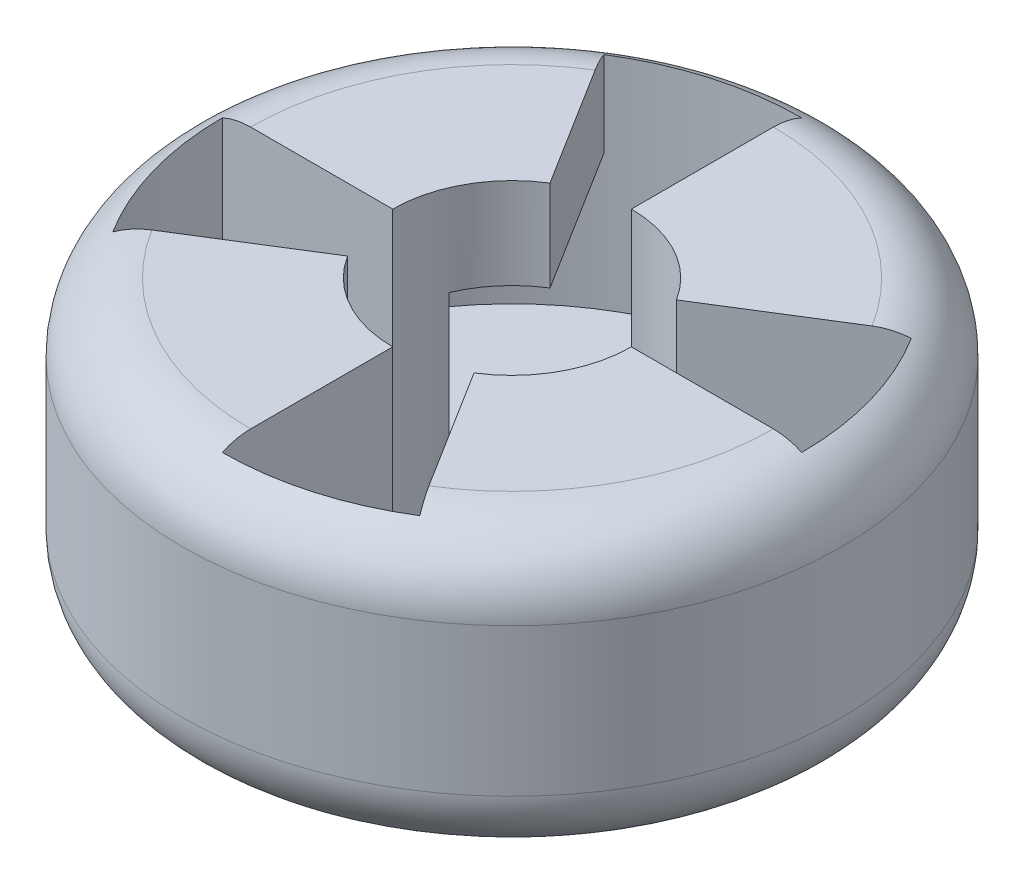
ISO-10303-21;
HEADER;
FILE_DESCRIPTION(('STEP AP214'),'2;1');
FILE_NAME('part.step','',(''),(''),'','','');
FILE_SCHEMA(('AUTOMOTIVE_DESIGN { 1 0 10303 214 1 1 1 1 }'));
ENDSEC;
DATA;
#1=APPLICATION_CONTEXT('core data for automotive mechanical design processes');
#2=APPLICATION_PROTOCOL_DEFINITION('international standard','automotive_design',2000,#1);
#3=PRODUCT_CONTEXT('',#1,'mechanical');
#4=PRODUCT('Part','Part','',(#3));
#5=PRODUCT_RELATED_PRODUCT_CATEGORY('part','',(#4));
#6=PRODUCT_DEFINITION_FORMATION('','',#4);
#7=PRODUCT_DEFINITION_CONTEXT('part definition',#1,'design');
#8=PRODUCT_DEFINITION('design','',#6,#7);
#9=PRODUCT_DEFINITION_SHAPE('','',#8);
#10=(LENGTH_UNIT() NAMED_UNIT(*) SI_UNIT(.MILLI.,.METRE.));
#11=(NAMED_UNIT(*) PLANE_ANGLE_UNIT() SI_UNIT($,.RADIAN.));
#12=(NAMED_UNIT(*) SI_UNIT($,.STERADIAN.) SOLID_ANGLE_UNIT());
#13=UNCERTAINTY_MEASURE_WITH_UNIT(LENGTH_MEASURE(1.E-05),#10,'distance_accuracy_value','');
#14=(GEOMETRIC_REPRESENTATION_CONTEXT(3) GLOBAL_UNCERTAINTY_ASSIGNED_CONTEXT((#13)) GLOBAL_UNIT_ASSIGNED_CONTEXT((#10,
#11,#12)) REPRESENTATION_CONTEXT('',''));
#15=CARTESIAN_POINT('',(0.,0.,0.));
#16=DIRECTION('',(0.,0.,1.));
#17=DIRECTION('',(1.,0.,0.));
#18=AXIS2_PLACEMENT_3D('',#15,#16,#17);
#19=CARTESIAN_POINT('',(0.,12.5,14.5));
#20=DIRECTION('',(0.,1.,0.));
#21=DIRECTION('',(0.,0.,1.));
#22=AXIS2_PLACEMENT_3D('',#19,#20,#21);
#23=PLANE('',#22);
#24=DIRECTION('',(-0.84804809615642,0.,0.529919264233215));
#25=VECTOR('',#24,1.);
#26=CARTESIAN_POINT('',(10.8126132259944,12.5,-6.75647061897349));
#27=LINE('',#26,#25);
#28=CARTESIAN_POINT('',(9.75255310579884,12.5,-6.09407153868197));
#29=VERTEX_POINT('',#28);
#30=CARTESIAN_POINT('',(4.45225250482121,12.5,-2.78207613722438));
#31=VERTEX_POINT('',#30);
#32=EDGE_CURVE('E398',#29,#31,#27,.T.);
#33=ORIENTED_EDGE('',*,*,#32,.F.);
#34=CARTESIAN_POINT('',(0.,12.5,0.));
#35=DIRECTION('',(0.,1.,0.));
#36=DIRECTION('',(0.,0.,1.));
#37=AXIS2_PLACEMENT_3D('',#34,#35,#36);
#38=CIRCLE('',#37,11.5);
#39=CARTESIAN_POINT('',(0.,12.5,-11.5));
#40=VERTEX_POINT('',#39);
#41=EDGE_CURVE('E345',#29,#40,#38,.T.);
#42=ORIENTED_EDGE('',*,*,#41,.T.);
#43=DIRECTION('',(0.,0.,-1.));
#44=VECTOR('',#43,1.);
#45=CARTESIAN_POINT('',(0.,12.5,14.5));
#46=LINE('',#45,#44);
#47=CARTESIAN_POINT('',(0.,12.5,-5.25000000000001));
#48=VERTEX_POINT('',#47);
#49=EDGE_CURVE('E283',#48,#40,#46,.T.);
#50=ORIENTED_EDGE('',*,*,#49,.F.);
#51=CARTESIAN_POINT('',(0.,12.5,0.));
#52=DIRECTION('',(0.,1.,0.));
#53=DIRECTION('',(0.,0.,1.));
#54=AXIS2_PLACEMENT_3D('',#51,#52,#53);
#55=CIRCLE('',#54,5.25000000000001);
#56=EDGE_CURVE('E274',#31,#48,#55,.T.);
#57=ORIENTED_EDGE('',*,*,#56,.F.);
#58=EDGE_LOOP('',(#33,#42,#50,#57));
#59=FACE_BOUND('',#58,.T.);
#60=ADVANCED_FACE('F40',(#59),#23,.T.);
#61=DIRECTION('',(0.529919264233206,0.,0.848048096156425));
#62=VECTOR('',#61,1.);
#63=CARTESIAN_POINT('',(-6.75647061897338,12.5,-10.8126132259944));
#64=LINE('',#63,#62);
#65=CARTESIAN_POINT('',(-6.09407153868188,12.5,-9.7525531057989));
#66=VERTEX_POINT('',#65);
#67=CARTESIAN_POINT('',(-2.78207613722434,12.5,-4.45225250482124));
#68=VERTEX_POINT('',#67);
#69=EDGE_CURVE('E256',#66,#68,#64,.T.);
#70=ORIENTED_EDGE('',*,*,#69,.F.);
#71=CARTESIAN_POINT('',(0.,12.5,0.));
#72=DIRECTION('',(0.,1.,0.));
#73=DIRECTION('',(0.,0.,1.));
#74=AXIS2_PLACEMENT_3D('',#71,#72,#73);
#75=CIRCLE('',#74,11.5);
#76=CARTESIAN_POINT('',(-11.5,12.5,0.));
#77=VERTEX_POINT('',#76);
#78=EDGE_CURVE('E343',#66,#77,#75,.T.);
#79=ORIENTED_EDGE('',*,*,#78,.T.);
#80=DIRECTION('',(-1.,0.,0.));
#81=VECTOR('',#80,1.);
#82=CARTESIAN_POINT('',(0.,12.5,0.));
#83=LINE('',#82,#81);
#84=CARTESIAN_POINT('',(-5.25000000000001,12.5,0.));
#85=VERTEX_POINT('',#84);
#86=EDGE_CURVE('E288',#85,#77,#83,.T.);
#87=ORIENTED_EDGE('',*,*,#86,.F.);
#88=EDGE_CURVE('E275',#68,#85,#55,.T.);
#89=ORIENTED_EDGE('',*,*,#88,.F.);
#90=EDGE_LOOP('',(#70,#79,#87,#89));
#91=FACE_BOUND('',#90,.T.);
#92=ADVANCED_FACE('F366',(#91),#23,.T.);
#93=DIRECTION('',(0.848048096156424,0.,-0.529919264233209));
#94=VECTOR('',#93,1.);
#95=CARTESIAN_POINT('',(-10.8126132259944,12.5,6.75647061897342));
#96=LINE('',#95,#94);
#97=CARTESIAN_POINT('',(-9.75255310579887,12.5,6.09407153868191));
#98=VERTEX_POINT('',#97);
#99=CARTESIAN_POINT('',(-4.45225250482123,12.5,2.78207613722435));
#100=VERTEX_POINT('',#99);
#101=EDGE_CURVE('E244',#98,#100,#96,.T.);
#102=ORIENTED_EDGE('',*,*,#101,.F.);
#103=CARTESIAN_POINT('',(0.,12.5,0.));
#104=DIRECTION('',(0.,1.,0.));
#105=DIRECTION('',(0.,0.,1.));
#106=AXIS2_PLACEMENT_3D('',#103,#104,#105);
#107=CIRCLE('',#106,11.5);
#108=CARTESIAN_POINT('',(0.,12.5,11.5));
#109=VERTEX_POINT('',#108);
#110=EDGE_CURVE('E341',#98,#109,#107,.T.);
#111=ORIENTED_EDGE('',*,*,#110,.T.);
#112=DIRECTION('',(0.,0.,1.));
#113=VECTOR('',#112,1.);
#114=CARTESIAN_POINT('',(0.,12.5,14.5));
#115=LINE('',#114,#113);
#116=CARTESIAN_POINT('',(0.,12.5,5.25));
#117=VERTEX_POINT('',#116);
#118=EDGE_CURVE('E291',#117,#109,#115,.T.);
#119=ORIENTED_EDGE('',*,*,#118,.F.);
#120=EDGE_CURVE('E279',#100,#117,#55,.T.);
#121=ORIENTED_EDGE('',*,*,#120,.F.);
#122=EDGE_LOOP('',(#102,#111,#119,#121));
#123=FACE_BOUND('',#122,.T.);
#124=ADVANCED_FACE('F491',(#123),#23,.T.);
#125=CARTESIAN_POINT('',(0.,0.,5.25));
#126=DIRECTION('',(0.,-1.,0.));
#127=DIRECTION('',(0.,0.,-1.));
#128=AXIS2_PLACEMENT_3D('',#125,#126,#127);
#129=PLANE('',#128);
#130=DIRECTION('',(-1.,0.,0.));
#131=VECTOR('',#130,1.);
#132=CARTESIAN_POINT('',(0.,0.,0.));
#133=LINE('',#132,#131);
#134=CARTESIAN_POINT('',(11.5,0.,-1.20549995778023E-13));
#135=VERTEX_POINT('',#134);
#136=CARTESIAN_POINT('',(5.25000000000001,0.,0.));
#137=VERTEX_POINT('',#136);
#138=EDGE_CURVE('E400',#135,#137,#133,.T.);
#139=ORIENTED_EDGE('',*,*,#138,.F.);
#140=CARTESIAN_POINT('',(0.,0.,0.));
#141=DIRECTION('',(0.,-1.,0.));
#142=DIRECTION('',(0.,0.,-1.));
#143=AXIS2_PLACEMENT_3D('',#140,#141,#142);
#144=CIRCLE('',#143,11.5);
#145=CARTESIAN_POINT('',(-9.75255310579888,0.,6.0940715386819));
#146=VERTEX_POINT('',#145);
#147=EDGE_CURVE('E312',#135,#146,#144,.T.);
#148=ORIENTED_EDGE('',*,*,#147,.T.);
#149=DIRECTION('',(-0.848048096156424,0.,0.529919264233208));
#150=VECTOR('',#149,1.);
#151=CARTESIAN_POINT('',(-2.35933437153532,0.,1.47427573967869));
#152=LINE('',#151,#150);
#153=CARTESIAN_POINT('',(-4.45225250482123,0.,2.78207613722435));
#154=VERTEX_POINT('',#153);
#155=EDGE_CURVE('E394',#154,#146,#152,.T.);
#156=ORIENTED_EDGE('',*,*,#155,.F.);
#157=CARTESIAN_POINT('',(0.,0.,0.));
#158=DIRECTION('',(0.,1.,0.));
#159=DIRECTION('',(0.,0.,1.));
#160=AXIS2_PLACEMENT_3D('',#157,#158,#159);
#161=CIRCLE('',#160,5.25000000000001);
#162=EDGE_CURVE('E278',#154,#137,#161,.T.);
#163=ORIENTED_EDGE('',*,*,#162,.T.);
#164=EDGE_LOOP('',(#139,#148,#156,#163));
#165=FACE_BOUND('',#164,.T.);
#166=ADVANCED_FACE('F483',(#165),#129,.T.);
#167=CARTESIAN_POINT('',(0.,31.,0.));
#168=DIRECTION('',(0.,1.,0.));
#169=DIRECTION('',(0.,0.,1.));
#170=AXIS2_PLACEMENT_3D('',#167,#168,#169);
#171=CYLINDRICAL_SURFACE('',#170,5.25000000000001);
#172=CARTESIAN_POINT('',(0.,8.5,0.));
#173=DIRECTION('',(0.,1.,0.));
#174=DIRECTION('',(0.,0.,1.));
#175=AXIS2_PLACEMENT_3D('',#172,#173,#174);
#176=CIRCLE('',#175,5.25000000000001);
#177=CARTESIAN_POINT('',(-2.78207613722434,8.5,-4.45225250482124));
#178=VERTEX_POINT('',#177);
#179=CARTESIAN_POINT('',(-4.83265048062533,8.5,-2.05133842456868));
#180=VERTEX_POINT('',#179);
#181=EDGE_CURVE('E473',#178,#180,#176,.T.);
#182=ORIENTED_EDGE('',*,*,#181,.F.);
#183=DIRECTION('',(0.,1.,0.));
#184=VECTOR('',#183,1.);
#185=CARTESIAN_POINT('',(-2.78207613722434,31.,-4.45225250482124));
#186=LINE('',#185,#184);
#187=EDGE_CURVE('E266',#68,#178,#186,.F.);
#188=ORIENTED_EDGE('',*,*,#187,.F.);
#189=ORIENTED_EDGE('',*,*,#88,.T.);
#190=DIRECTION('',(0.,1.,0.));
#191=VECTOR('',#190,1.);
#192=CARTESIAN_POINT('',(-5.25000000000001,31.,0.));
#193=LINE('',#192,#191);
#194=CARTESIAN_POINT('',(-5.25000000000001,0.,0.));
#195=VERTEX_POINT('',#194);
#196=EDGE_CURVE('E254',#195,#85,#193,.T.);
#197=ORIENTED_EDGE('',*,*,#196,.F.);
#198=CARTESIAN_POINT('',(4.45225250482121,0.,-2.78207613722438));
#199=VERTEX_POINT('',#198);
#200=EDGE_CURVE('E282',#199,#195,#161,.T.);
#201=ORIENTED_EDGE('',*,*,#200,.F.);
#202=DIRECTION('',(0.,1.,0.));
#203=VECTOR('',#202,1.);
#204=CARTESIAN_POINT('',(4.45225250482121,31.,-2.78207613722438));
#205=LINE('',#204,#203);
#206=EDGE_CURVE('E409',#31,#199,#205,.F.);
#207=ORIENTED_EDGE('',*,*,#206,.F.);
#208=ORIENTED_EDGE('',*,*,#56,.T.);
#209=DIRECTION('',(0.,1.,0.));
#210=VECTOR('',#209,1.);
#211=CARTESIAN_POINT('',(0.,31.,-5.25000000000001));
#212=LINE('',#211,#210);
#213=CARTESIAN_POINT('',(0.,2.5,-5.25000000000001));
#214=VERTEX_POINT('',#213);
#215=EDGE_CURVE('E271',#214,#48,#212,.T.);
#216=ORIENTED_EDGE('',*,*,#215,.F.);
#217=CARTESIAN_POINT('',(0.,2.5,0.));
#218=DIRECTION('',(0.,1.,0.));
#219=DIRECTION('',(0.,0.,1.));
#220=AXIS2_PLACEMENT_3D('',#217,#218,#219);
#221=CIRCLE('',#220,5.25000000000001);
#222=CARTESIAN_POINT('',(-4.83265048062533,2.5,-2.05133842456868));
#223=VERTEX_POINT('',#222);
#224=EDGE_CURVE('E286',#214,#223,#221,.T.);
#225=ORIENTED_EDGE('',*,*,#224,.T.);
#226=DIRECTION('',(0.,1.,0.));
#227=VECTOR('',#226,1.);
#228=CARTESIAN_POINT('',(-4.83265048062532,31.,-2.05133842456867));
#229=LINE('',#228,#227);
#230=EDGE_CURVE('E298',#223,#180,#229,.T.);
#231=ORIENTED_EDGE('',*,*,#230,.T.);
#232=EDGE_LOOP('',(#182,#188,#189,#197,#201,#207,#208,#216,#225,#231));
#233=FACE_BOUND('',#232,.T.);
#234=ADVANCED_FACE('F434',(#233),#171,.F.);
#235=CARTESIAN_POINT('',(0.,8.5,0.));
#236=DIRECTION('',(0.,1.,0.));
#237=DIRECTION('',(0.,0.,1.));
#238=AXIS2_PLACEMENT_3D('',#235,#236,#237);
#239=CIRCLE('',#238,5.25000000000001);
#240=CARTESIAN_POINT('',(2.78207613722433,8.5,4.45225250482124));
#241=VERTEX_POINT('',#240);
#242=CARTESIAN_POINT('',(4.83265048062532,8.5,2.05133842456868));
#243=VERTEX_POINT('',#242);
#244=EDGE_CURVE('E425',#241,#243,#239,.T.);
#245=ORIENTED_EDGE('',*,*,#244,.F.);
#246=DIRECTION('',(0.,1.,0.));
#247=VECTOR('',#246,1.);
#248=CARTESIAN_POINT('',(2.78207613722433,31.,4.45225250482124));
#249=LINE('',#248,#247);
#250=CARTESIAN_POINT('',(2.78207613722433,12.5,4.45225250482124));
#251=VERTEX_POINT('',#250);
#252=EDGE_CURVE('E230',#251,#241,#249,.F.);
#253=ORIENTED_EDGE('',*,*,#252,.F.);
#254=CARTESIAN_POINT('',(5.25000000000001,12.5,0.));
#255=VERTEX_POINT('',#254);
#256=EDGE_CURVE('E424',#251,#255,#55,.T.);
#257=ORIENTED_EDGE('',*,*,#256,.T.);
#258=DIRECTION('',(0.,1.,0.));
#259=VECTOR('',#258,1.);
#260=CARTESIAN_POINT('',(5.25000000000001,31.,0.));
#261=LINE('',#260,#259);
#262=EDGE_CURVE('E413',#137,#255,#261,.T.);
#263=ORIENTED_EDGE('',*,*,#262,.F.);
#264=ORIENTED_EDGE('',*,*,#162,.F.);
#265=DIRECTION('',(0.,1.,0.));
#266=VECTOR('',#265,1.);
#267=CARTESIAN_POINT('',(-4.45225250482123,31.,2.78207613722435));
#268=LINE('',#267,#266);
#269=EDGE_CURVE('E250',#100,#154,#268,.F.);
#270=ORIENTED_EDGE('',*,*,#269,.F.);
#271=ORIENTED_EDGE('',*,*,#120,.T.);
#272=DIRECTION('',(0.,1.,0.));
#273=VECTOR('',#272,1.);
#274=CARTESIAN_POINT('',(0.,31.,5.25000000000001));
#275=LINE('',#274,#273);
#276=CARTESIAN_POINT('',(0.,2.5,5.25));
#277=VERTEX_POINT('',#276);
#278=EDGE_CURVE('E242',#277,#117,#275,.T.);
#279=ORIENTED_EDGE('',*,*,#278,.F.);
#280=CARTESIAN_POINT('',(0.,2.5,0.));
#281=DIRECTION('',(0.,1.,0.));
#282=DIRECTION('',(0.,0.,1.));
#283=AXIS2_PLACEMENT_3D('',#280,#281,#282);
#284=CIRCLE('',#283,5.25000000000001);
#285=CARTESIAN_POINT('',(4.83265048062532,2.5,2.05133842456868));
#286=VERTEX_POINT('',#285);
#287=EDGE_CURVE('E293',#277,#286,#284,.T.);
#288=ORIENTED_EDGE('',*,*,#287,.T.);
#289=DIRECTION('',(0.,1.,0.));
#290=VECTOR('',#289,1.);
#291=CARTESIAN_POINT('',(4.83265048062532,31.,2.05133842456868));
#292=LINE('',#291,#290);
#293=EDGE_CURVE('E301',#286,#243,#292,.T.);
#294=ORIENTED_EDGE('',*,*,#293,.T.);
#295=EDGE_LOOP('',(#245,#253,#257,#263,#264,#270,#271,#279,#288,#294));
#296=FACE_BOUND('',#295,.T.);
#297=ADVANCED_FACE('F422',(#296),#171,.F.);
#298=DIRECTION('',(1.,0.,0.));
#299=VECTOR('',#298,1.);
#300=CARTESIAN_POINT('',(0.,0.,0.));
#301=LINE('',#300,#299);
#302=CARTESIAN_POINT('',(-11.5,0.,0.));
#303=VERTEX_POINT('',#302);
#304=EDGE_CURVE('E386',#303,#195,#301,.T.);
#305=ORIENTED_EDGE('',*,*,#304,.F.);
#306=CARTESIAN_POINT('',(0.,0.,0.));
#307=DIRECTION('',(0.,-1.,0.));
#308=DIRECTION('',(0.,0.,-1.));
#309=AXIS2_PLACEMENT_3D('',#306,#307,#308);
#310=CIRCLE('',#309,11.5);
#311=CARTESIAN_POINT('',(9.75255310579884,0.,-6.09407153868198));
#312=VERTEX_POINT('',#311);
#313=EDGE_CURVE('E310',#303,#312,#310,.T.);
#314=ORIENTED_EDGE('',*,*,#313,.T.);
#315=DIRECTION('',(0.84804809615642,0.,-0.529919264233215));
#316=VECTOR('',#315,1.);
#317=CARTESIAN_POINT('',(-2.35933437153534,0.,1.47427573967872));
#318=LINE('',#317,#316);
#319=EDGE_CURVE('E395',#199,#312,#318,.T.);
#320=ORIENTED_EDGE('',*,*,#319,.F.);
#321=ORIENTED_EDGE('',*,*,#200,.T.);
#322=EDGE_LOOP('',(#305,#314,#320,#321));
#323=FACE_BOUND('',#322,.T.);
#324=ADVANCED_FACE('F390',(#323),#129,.T.);
#325=CARTESIAN_POINT('',(0.,31.,0.));
#326=DIRECTION('',(0.,1.,0.));
#327=DIRECTION('',(0.,0.,1.));
#328=AXIS2_PLACEMENT_3D('',#325,#326,#327);
#329=CYLINDRICAL_SURFACE('',#328,14.5);
#330=CARTESIAN_POINT('',(0.,3.,0.));
#331=DIRECTION('',(0.,-1.,0.));
#332=DIRECTION('',(0.,0.,-1.));
#333=AXIS2_PLACEMENT_3D('',#330,#331,#332);
#334=CIRCLE('',#333,14.5);
#335=CARTESIAN_POINT('',(0.,3.,-14.5));
#336=VERTEX_POINT('',#335);
#337=EDGE_CURVE('E307',#336,#336,#334,.F.);
#338=ORIENTED_EDGE('',*,*,#337,.T.);
#339=EDGE_LOOP('',(#338));
#340=FACE_BOUND('',#339,.T.);
#341=CARTESIAN_POINT('',(0.,9.5,0.));
#342=DIRECTION('',(0.,1.,0.));
#343=DIRECTION('',(0.,0.,1.));
#344=AXIS2_PLACEMENT_3D('',#341,#342,#343);
#345=CIRCLE('',#344,14.5);
#346=CARTESIAN_POINT('',(0.,9.49999999999999,14.5));
#347=VERTEX_POINT('',#346);
#348=EDGE_CURVE('E304',#347,#347,#345,.F.);
#349=ORIENTED_EDGE('',*,*,#348,.T.);
#350=EDGE_LOOP('',(#349));
#351=FACE_BOUND('',#350,.T.);
#352=ADVANCED_FACE('F521',(#340,#351),#329,.T.);
#353=DIRECTION('',(-0.529919264233206,0.,-0.848048096156425));
#354=VECTOR('',#353,1.);
#355=CARTESIAN_POINT('',(6.75647061897338,12.5,10.8126132259944));
#356=LINE('',#355,#354);
#357=CARTESIAN_POINT('',(6.09407153868187,12.5,9.7525531057989));
#358=VERTEX_POINT('',#357);
#359=EDGE_CURVE('E415',#358,#251,#356,.T.);
#360=ORIENTED_EDGE('',*,*,#359,.F.);
#361=CARTESIAN_POINT('',(0.,12.5,0.));
#362=DIRECTION('',(0.,1.,0.));
#363=DIRECTION('',(0.,0.,1.));
#364=AXIS2_PLACEMENT_3D('',#361,#362,#363);
#365=CIRCLE('',#364,11.5);
#366=CARTESIAN_POINT('',(11.5,12.5,-1.18776611883486E-13));
#367=VERTEX_POINT('',#366);
#368=EDGE_CURVE('E339',#358,#367,#365,.T.);
#369=ORIENTED_EDGE('',*,*,#368,.T.);
#370=DIRECTION('',(1.,0.,0.));
#371=VECTOR('',#370,1.);
#372=CARTESIAN_POINT('',(-1.51949075018451E-13,12.5,0.));
#373=LINE('',#372,#371);
#374=EDGE_CURVE('E295',#255,#367,#373,.T.);
#375=ORIENTED_EDGE('',*,*,#374,.F.);
#376=ORIENTED_EDGE('',*,*,#256,.F.);
#377=EDGE_LOOP('',(#360,#369,#375,#376));
#378=FACE_BOUND('',#377,.T.);
#379=ADVANCED_FACE('F427',(#378),#23,.T.);
#380=CARTESIAN_POINT('',(0.,2.5,0.));
#381=DIRECTION('',(0.,1.,0.));
#382=DIRECTION('',(0.,0.,1.));
#383=AXIS2_PLACEMENT_3D('',#380,#381,#382);
#384=CYLINDRICAL_SURFACE('',#383,12.75);
#385=DIRECTION('',(0.,1.,0.));
#386=VECTOR('',#385,1.);
#387=CARTESIAN_POINT('',(0.,2.5,-12.75));
#388=LINE('',#387,#386);
#389=CARTESIAN_POINT('',(0.,2.5,-12.75));
#390=VERTEX_POINT('',#389);
#391=CARTESIAN_POINT('',(0.,12.2271780286589,-12.75));
#392=VERTEX_POINT('',#391);
#393=EDGE_CURVE('E263',#390,#392,#388,.T.);
#394=ORIENTED_EDGE('',*,*,#393,.T.);
#395=CARTESIAN_POINT('',(0.,12.2271780286589,0.));
#396=DIRECTION('',(0.,1.,0.));
#397=DIRECTION('',(0.,0.,1.));
#398=AXIS2_PLACEMENT_3D('',#395,#396,#397);
#399=CIRCLE('',#398,12.75);
#400=CARTESIAN_POINT('',(-6.75647061897338,12.2271780286589,-10.8126132259944));
#401=VERTEX_POINT('',#400);
#402=EDGE_CURVE('E350',#392,#401,#399,.T.);
#403=ORIENTED_EDGE('',*,*,#402,.T.);
#404=DIRECTION('',(0.,1.,0.));
#405=VECTOR('',#404,1.);
#406=CARTESIAN_POINT('',(-6.75647061897338,2.5,-10.8126132259944));
#407=LINE('',#406,#405);
#408=CARTESIAN_POINT('',(-6.75647061897338,8.5,-10.8126132259944));
#409=VERTEX_POINT('',#408);
#410=EDGE_CURVE('E261',#409,#401,#407,.T.);
#411=ORIENTED_EDGE('',*,*,#410,.F.);
#412=CARTESIAN_POINT('',(0.,8.5,0.));
#413=DIRECTION('',(0.,1.,0.));
#414=DIRECTION('',(0.,0.,1.));
#415=AXIS2_PLACEMENT_3D('',#412,#413,#414);
#416=CIRCLE('',#415,12.75);
#417=CARTESIAN_POINT('',(-11.7364368815186,8.5,-4.98182188823821));
#418=VERTEX_POINT('',#417);
#419=EDGE_CURVE('E465',#409,#418,#416,.T.);
#420=ORIENTED_EDGE('',*,*,#419,.T.);
#421=DIRECTION('',(0.,-1.,0.));
#422=VECTOR('',#421,1.);
#423=CARTESIAN_POINT('',(-11.7364368815186,8.5,-4.98182188823821));
#424=LINE('',#423,#422);
#425=CARTESIAN_POINT('',(-11.7364368815186,2.5,-4.98182188823821));
#426=VERTEX_POINT('',#425);
#427=EDGE_CURVE('E450',#418,#426,#424,.T.);
#428=ORIENTED_EDGE('',*,*,#427,.T.);
#429=CARTESIAN_POINT('',(0.,2.5,0.));
#430=DIRECTION('',(0.,1.,0.));
#431=DIRECTION('',(0.,0.,1.));
#432=AXIS2_PLACEMENT_3D('',#429,#430,#431);
#433=CIRCLE('',#432,12.75);
#434=EDGE_CURVE('E257',#390,#426,#433,.T.);
#435=ORIENTED_EDGE('',*,*,#434,.F.);
#436=EDGE_LOOP('',(#394,#403,#411,#420,#428,#435));
#437=FACE_BOUND('',#436,.T.);
#438=ADVANCED_FACE('F447',(#437),#384,.F.);
#439=CARTESIAN_POINT('',(0.,2.5,-12.75));
#440=DIRECTION('',(1.,0.,0.));
#441=DIRECTION('',(0.,0.,-1.));
#442=AXIS2_PLACEMENT_3D('',#439,#440,#441);
#443=PLANE('',#442);
#444=ORIENTED_EDGE('',*,*,#49,.T.);
#445=CARTESIAN_POINT('',(0.,9.5,-11.5));
#446=DIRECTION('',(1.,0.,0.));
#447=DIRECTION('',(0.,0.,-1.));
#448=AXIS2_PLACEMENT_3D('',#445,#446,#447);
#449=CIRCLE('',#448,3.);
#450=EDGE_CURVE('E348',#40,#392,#449,.F.);
#451=ORIENTED_EDGE('',*,*,#450,.T.);
#452=ORIENTED_EDGE('',*,*,#393,.F.);
#453=DIRECTION('',(0.,0.,-1.));
#454=VECTOR('',#453,1.);
#455=CARTESIAN_POINT('',(0.,2.5,-12.75));
#456=LINE('',#455,#454);
#457=EDGE_CURVE('E259',#214,#390,#456,.T.);
#458=ORIENTED_EDGE('',*,*,#457,.F.);
#459=ORIENTED_EDGE('',*,*,#215,.T.);
#460=EDGE_LOOP('',(#444,#451,#452,#458,#459));
#461=FACE_BOUND('',#460,.T.);
#462=ADVANCED_FACE('F440',(#461),#443,.F.);
#463=CARTESIAN_POINT('',(-6.75647061897338,2.5,-10.8126132259944));
#464=DIRECTION('',(-0.848048096156425,0.,0.529919264233206));
#465=DIRECTION('',(0.529919264233206,0.,0.848048096156425));
#466=AXIS2_PLACEMENT_3D('',#463,#464,#465);
#467=PLANE('',#466);
#468=ORIENTED_EDGE('',*,*,#410,.T.);
#469=CARTESIAN_POINT('',(-6.09407153868187,9.5,-9.7525531057989));
#470=DIRECTION('',(-0.848048096156425,0.,0.529919264233206));
#471=DIRECTION('',(0.529919264233206,0.,0.848048096156425));
#472=AXIS2_PLACEMENT_3D('',#469,#470,#471);
#473=CIRCLE('',#472,3.);
#474=EDGE_CURVE('E352',#401,#66,#473,.F.);
#475=ORIENTED_EDGE('',*,*,#474,.T.);
#476=ORIENTED_EDGE('',*,*,#69,.T.);
#477=ORIENTED_EDGE('',*,*,#187,.T.);
#478=DIRECTION('',(-0.529919264233206,0.,-0.848048096156425));
#479=VECTOR('',#478,1.);
#480=CARTESIAN_POINT('',(0.,8.5,0.));
#481=LINE('',#480,#479);
#482=EDGE_CURVE('E463',#178,#409,#481,.T.);
#483=ORIENTED_EDGE('',*,*,#482,.T.);
#484=EDGE_LOOP('',(#468,#475,#476,#477,#483));
#485=FACE_BOUND('',#484,.T.);
#486=ADVANCED_FACE('F357',(#485),#467,.F.);
#487=CARTESIAN_POINT('',(0.,2.5,0.));
#488=DIRECTION('',(0.,1.,0.));
#489=DIRECTION('',(0.,0.,1.));
#490=AXIS2_PLACEMENT_3D('',#487,#488,#489);
#491=PLANE('',#490);
#492=ORIENTED_EDGE('',*,*,#457,.T.);
#493=ORIENTED_EDGE('',*,*,#434,.T.);
#494=DIRECTION('',(0.920504853452441,0.,0.390731128489271));
#495=VECTOR('',#494,1.);
#496=CARTESIAN_POINT('',(0.,2.5,0.));
#497=LINE('',#496,#495);
#498=EDGE_CURVE('E455',#426,#223,#497,.T.);
#499=ORIENTED_EDGE('',*,*,#498,.T.);
#500=ORIENTED_EDGE('',*,*,#224,.F.);
#501=EDGE_LOOP('',(#492,#493,#499,#500));
#502=FACE_BOUND('',#501,.T.);
#503=ADVANCED_FACE('F454',(#502),#491,.T.);
#504=CARTESIAN_POINT('',(0.,2.5,0.));
#505=DIRECTION('',(0.,1.,0.));
#506=DIRECTION('',(0.,0.,1.));
#507=AXIS2_PLACEMENT_3D('',#504,#505,#506);
#508=CYLINDRICAL_SURFACE('',#507,12.75);
#509=DIRECTION('',(0.,1.,0.));
#510=VECTOR('',#509,1.);
#511=CARTESIAN_POINT('',(-10.8126132259944,2.5,6.75647061897341));
#512=LINE('',#511,#510);
#513=CARTESIAN_POINT('',(-10.8126132259944,0.272821971341068,6.75647061897341));
#514=VERTEX_POINT('',#513);
#515=CARTESIAN_POINT('',(-10.8126132259944,12.2271780286589,6.75647061897341));
#516=VERTEX_POINT('',#515);
#517=EDGE_CURVE('E246',#514,#516,#512,.T.);
#518=ORIENTED_EDGE('',*,*,#517,.F.);
#519=CARTESIAN_POINT('',(0.,0.27282197134107,0.));
#520=DIRECTION('',(0.,1.,0.));
#521=DIRECTION('',(0.,0.,1.));
#522=AXIS2_PLACEMENT_3D('',#519,#520,#521);
#523=CIRCLE('',#522,12.75);
#524=CARTESIAN_POINT('',(-12.75,0.272821971341067,0.));
#525=VERTEX_POINT('',#524);
#526=EDGE_CURVE('E321',#514,#525,#523,.F.);
#527=ORIENTED_EDGE('',*,*,#526,.T.);
#528=DIRECTION('',(0.,1.,0.));
#529=VECTOR('',#528,1.);
#530=CARTESIAN_POINT('',(-12.75,2.5,0.));
#531=LINE('',#530,#529);
#532=CARTESIAN_POINT('',(-12.75,12.2271780286589,0.));
#533=VERTEX_POINT('',#532);
#534=EDGE_CURVE('E247',#525,#533,#531,.T.);
#535=ORIENTED_EDGE('',*,*,#534,.T.);
#536=CARTESIAN_POINT('',(0.,12.2271780286589,0.));
#537=DIRECTION('',(0.,1.,0.));
#538=DIRECTION('',(0.,0.,1.));
#539=AXIS2_PLACEMENT_3D('',#536,#537,#538);
#540=CIRCLE('',#539,12.75);
#541=EDGE_CURVE('E319',#533,#516,#540,.T.);
#542=ORIENTED_EDGE('',*,*,#541,.T.);
#543=EDGE_LOOP('',(#518,#527,#535,#542));
#544=FACE_BOUND('',#543,.T.);
#545=ADVANCED_FACE('F377',(#544),#508,.F.);
#546=CARTESIAN_POINT('',(-12.75,2.5,0.));
#547=DIRECTION('',(0.,0.,-1.));
#548=DIRECTION('',(-1.,0.,0.));
#549=AXIS2_PLACEMENT_3D('',#546,#547,#548);
#550=PLANE('',#549);
#551=ORIENTED_EDGE('',*,*,#534,.F.);
#552=CARTESIAN_POINT('',(-11.5,3.,0.));
#553=DIRECTION('',(0.,0.,-1.));
#554=DIRECTION('',(-1.,0.,0.));
#555=AXIS2_PLACEMENT_3D('',#552,#553,#554);
#556=CIRCLE('',#555,3.);
#557=EDGE_CURVE('E325',#525,#303,#556,.F.);
#558=ORIENTED_EDGE('',*,*,#557,.T.);
#559=ORIENTED_EDGE('',*,*,#304,.T.);
#560=ORIENTED_EDGE('',*,*,#196,.T.);
#561=ORIENTED_EDGE('',*,*,#86,.T.);
#562=CARTESIAN_POINT('',(-11.5,9.5,0.));
#563=DIRECTION('',(0.,0.,-1.));
#564=DIRECTION('',(-1.,0.,0.));
#565=AXIS2_PLACEMENT_3D('',#562,#563,#564);
#566=CIRCLE('',#565,3.);
#567=EDGE_CURVE('E323',#77,#533,#566,.F.);
#568=ORIENTED_EDGE('',*,*,#567,.T.);
#569=EDGE_LOOP('',(#551,#558,#559,#560,#561,#568));
#570=FACE_BOUND('',#569,.T.);
#571=ADVANCED_FACE('F373',(#570),#550,.F.);
#572=CARTESIAN_POINT('',(-10.8126132259944,2.5,6.75647061897341));
#573=DIRECTION('',(0.529919264233209,0.,0.848048096156424));
#574=DIRECTION('',(0.848048096156424,0.,-0.529919264233209));
#575=AXIS2_PLACEMENT_3D('',#572,#573,#574);
#576=PLANE('',#575);
#577=ORIENTED_EDGE('',*,*,#155,.T.);
#578=CARTESIAN_POINT('',(-9.75255310579888,3.,6.0940715386819));
#579=DIRECTION('',(0.529919264233209,0.,0.848048096156424));
#580=DIRECTION('',(0.848048096156424,0.,-0.529919264233209));
#581=AXIS2_PLACEMENT_3D('',#578,#579,#580);
#582=CIRCLE('',#581,3.);
#583=EDGE_CURVE('E317',#146,#514,#582,.F.);
#584=ORIENTED_EDGE('',*,*,#583,.T.);
#585=ORIENTED_EDGE('',*,*,#517,.T.);
#586=CARTESIAN_POINT('',(-9.75255310579888,9.5,6.0940715386819));
#587=DIRECTION('',(0.529919264233209,0.,0.848048096156424));
#588=DIRECTION('',(0.848048096156424,0.,-0.529919264233209));
#589=AXIS2_PLACEMENT_3D('',#586,#587,#588);
#590=CIRCLE('',#589,3.);
#591=EDGE_CURVE('E315',#516,#98,#590,.F.);
#592=ORIENTED_EDGE('',*,*,#591,.T.);
#593=ORIENTED_EDGE('',*,*,#101,.T.);
#594=ORIENTED_EDGE('',*,*,#269,.T.);
#595=EDGE_LOOP('',(#577,#584,#585,#592,#593,#594));
#596=FACE_BOUND('',#595,.T.);
#597=ADVANCED_FACE('F485',(#596),#576,.F.);
#598=CARTESIAN_POINT('',(0.,2.5,0.));
#599=DIRECTION('',(0.,1.,0.));
#600=DIRECTION('',(0.,0.,1.));
#601=AXIS2_PLACEMENT_3D('',#598,#599,#600);
#602=CYLINDRICAL_SURFACE('',#601,12.75);
#603=DIRECTION('',(0.,1.,0.));
#604=VECTOR('',#603,1.);
#605=CARTESIAN_POINT('',(0.,2.5,12.75));
#606=LINE('',#605,#604);
#607=CARTESIAN_POINT('',(0.,2.5,12.75));
#608=VERTEX_POINT('',#607);
#609=CARTESIAN_POINT('',(0.,12.2271780286589,12.75));
#610=VERTEX_POINT('',#609);
#611=EDGE_CURVE('E233',#608,#610,#606,.T.);
#612=ORIENTED_EDGE('',*,*,#611,.T.);
#613=CARTESIAN_POINT('',(0.,12.2271780286589,0.));
#614=DIRECTION('',(0.,1.,0.));
#615=DIRECTION('',(0.,0.,1.));
#616=AXIS2_PLACEMENT_3D('',#613,#614,#615);
#617=CIRCLE('',#616,12.75);
#618=CARTESIAN_POINT('',(6.75647061897338,12.2271780286589,10.8126132259944));
#619=VERTEX_POINT('',#618);
#620=EDGE_CURVE('E48',#610,#619,#617,.T.);
#621=ORIENTED_EDGE('',*,*,#620,.T.);
#622=DIRECTION('',(0.,1.,0.));
#623=VECTOR('',#622,1.);
#624=CARTESIAN_POINT('',(6.75647061897338,2.5,10.8126132259944));
#625=LINE('',#624,#623);
#626=CARTESIAN_POINT('',(6.75647061897338,8.5,10.8126132259944));
#627=VERTEX_POINT('',#626);
#628=EDGE_CURVE('E227',#627,#619,#625,.T.);
#629=ORIENTED_EDGE('',*,*,#628,.F.);
#630=CARTESIAN_POINT('',(0.,8.5,0.));
#631=DIRECTION('',(0.,1.,0.));
#632=DIRECTION('',(0.,0.,-1.));
#633=AXIS2_PLACEMENT_3D('',#630,#631,#632);
#634=CIRCLE('',#633,12.75);
#635=CARTESIAN_POINT('',(11.7364368815186,8.5,4.98182188823821));
#636=VERTEX_POINT('',#635);
#637=EDGE_CURVE('E213',#627,#636,#634,.T.);
#638=ORIENTED_EDGE('',*,*,#637,.T.);
#639=DIRECTION('',(0.,-1.,0.));
#640=VECTOR('',#639,1.);
#641=CARTESIAN_POINT('',(11.7364368815186,8.5,4.98182188823821));
#642=LINE('',#641,#640);
#643=CARTESIAN_POINT('',(11.7364368815186,2.5,4.98182188823821));
#644=VERTEX_POINT('',#643);
#645=EDGE_CURVE('E222',#636,#644,#642,.T.);
#646=ORIENTED_EDGE('',*,*,#645,.T.);
#647=CARTESIAN_POINT('',(0.,2.5,0.));
#648=DIRECTION('',(0.,1.,0.));
#649=DIRECTION('',(0.,0.,-1.));
#650=AXIS2_PLACEMENT_3D('',#647,#648,#649);
#651=CIRCLE('',#650,12.75);
#652=EDGE_CURVE('E237',#608,#644,#651,.T.);
#653=ORIENTED_EDGE('',*,*,#652,.F.);
#654=EDGE_LOOP('',(#612,#621,#629,#638,#646,#653));
#655=FACE_BOUND('',#654,.T.);
#656=ADVANCED_FACE('F232',(#655),#602,.F.);
#657=CARTESIAN_POINT('',(0.,2.5,12.75));
#658=DIRECTION('',(-1.,0.,0.));
#659=DIRECTION('',(0.,0.,1.));
#660=AXIS2_PLACEMENT_3D('',#657,#658,#659);
#661=PLANE('',#660);
#662=ORIENTED_EDGE('',*,*,#118,.T.);
#663=CARTESIAN_POINT('',(0.,9.5,11.5));
#664=DIRECTION('',(-1.,0.,0.));
#665=DIRECTION('',(0.,0.,1.));
#666=AXIS2_PLACEMENT_3D('',#663,#664,#665);
#667=CIRCLE('',#666,3.);
#668=EDGE_CURVE('E62',#109,#610,#667,.F.);
#669=ORIENTED_EDGE('',*,*,#668,.T.);
#670=ORIENTED_EDGE('',*,*,#611,.F.);
#671=DIRECTION('',(0.,0.,1.));
#672=VECTOR('',#671,1.);
#673=CARTESIAN_POINT('',(0.,2.5,12.75));
#674=LINE('',#673,#672);
#675=EDGE_CURVE('E234',#277,#608,#674,.T.);
#676=ORIENTED_EDGE('',*,*,#675,.F.);
#677=ORIENTED_EDGE('',*,*,#278,.T.);
#678=EDGE_LOOP('',(#662,#669,#670,#676,#677));
#679=FACE_BOUND('',#678,.T.);
#680=ADVANCED_FACE('F493',(#679),#661,.F.);
#681=CARTESIAN_POINT('',(6.75647061897338,2.5,10.8126132259944));
#682=DIRECTION('',(0.848048096156425,0.,-0.529919264233206));
#683=DIRECTION('',(-0.529919264233206,0.,-0.848048096156425));
#684=AXIS2_PLACEMENT_3D('',#681,#682,#683);
#685=PLANE('',#684);
#686=ORIENTED_EDGE('',*,*,#628,.T.);
#687=CARTESIAN_POINT('',(6.09407153868187,9.5,9.75255310579889));
#688=DIRECTION('',(0.848048096156425,0.,-0.529919264233206));
#689=DIRECTION('',(-0.529919264233206,0.,-0.848048096156425));
#690=AXIS2_PLACEMENT_3D('',#687,#688,#689);
#691=CIRCLE('',#690,3.);
#692=EDGE_CURVE('E12',#619,#358,#691,.F.);
#693=ORIENTED_EDGE('',*,*,#692,.T.);
#694=ORIENTED_EDGE('',*,*,#359,.T.);
#695=ORIENTED_EDGE('',*,*,#252,.T.);
#696=DIRECTION('',(0.529919264233206,0.,0.848048096156425));
#697=VECTOR('',#696,1.);
#698=CARTESIAN_POINT('',(0.,8.5,0.));
#699=LINE('',#698,#697);
#700=EDGE_CURVE('E216',#241,#627,#699,.T.);
#701=ORIENTED_EDGE('',*,*,#700,.T.);
#702=EDGE_LOOP('',(#686,#693,#694,#695,#701));
#703=FACE_BOUND('',#702,.T.);
#704=ADVANCED_FACE('F226',(#703),#685,.F.);
#705=CARTESIAN_POINT('',(0.,2.5,0.));
#706=DIRECTION('',(0.,1.,0.));
#707=DIRECTION('',(0.,0.,-1.));
#708=AXIS2_PLACEMENT_3D('',#705,#706,#707);
#709=PLANE('',#708);
#710=ORIENTED_EDGE('',*,*,#675,.T.);
#711=ORIENTED_EDGE('',*,*,#652,.T.);
#712=DIRECTION('',(-0.920504853452441,0.,-0.390731128489271));
#713=VECTOR('',#712,1.);
#714=CARTESIAN_POINT('',(0.,2.5,0.));
#715=LINE('',#714,#713);
#716=EDGE_CURVE('E827',#644,#286,#715,.T.);
#717=ORIENTED_EDGE('',*,*,#716,.T.);
#718=ORIENTED_EDGE('',*,*,#287,.F.);
#719=EDGE_LOOP('',(#710,#711,#717,#718));
#720=FACE_BOUND('',#719,.T.);
#721=ADVANCED_FACE('F562',(#720),#709,.T.);
#722=CARTESIAN_POINT('',(0.,2.5,0.));
#723=DIRECTION('',(0.,1.,0.));
#724=DIRECTION('',(0.,0.,1.));
#725=AXIS2_PLACEMENT_3D('',#722,#723,#724);
#726=CYLINDRICAL_SURFACE('',#725,12.75);
#727=DIRECTION('',(0.,1.,0.));
#728=VECTOR('',#727,1.);
#729=CARTESIAN_POINT('',(10.8126132259944,2.5,-6.75647061897349));
#730=LINE('',#729,#728);
#731=CARTESIAN_POINT('',(10.8126132259944,0.272821971341067,-6.75647061897349));
#732=VERTEX_POINT('',#731);
#733=CARTESIAN_POINT('',(10.8126132259944,12.2271780286589,-6.75647061897349));
#734=VERTEX_POINT('',#733);
#735=EDGE_CURVE('E405',#732,#734,#730,.T.);
#736=ORIENTED_EDGE('',*,*,#735,.F.);
#737=CARTESIAN_POINT('',(0.,0.272821971341067,0.));
#738=DIRECTION('',(0.,1.,0.));
#739=DIRECTION('',(0.,0.,1.));
#740=AXIS2_PLACEMENT_3D('',#737,#738,#739);
#741=CIRCLE('',#740,12.75);
#742=CARTESIAN_POINT('',(12.75,0.272821971341067,-1.39254884583651E-13));
#743=VERTEX_POINT('',#742);
#744=EDGE_CURVE('E333',#732,#743,#741,.F.);
#745=ORIENTED_EDGE('',*,*,#744,.T.);
#746=DIRECTION('',(0.,1.,0.));
#747=VECTOR('',#746,1.);
#748=CARTESIAN_POINT('',(12.75,2.5,-1.33151151001027E-13));
#749=LINE('',#748,#747);
#750=CARTESIAN_POINT('',(12.75,12.2271780286589,-1.31364297385397E-13));
#751=VERTEX_POINT('',#750);
#752=EDGE_CURVE('E406',#743,#751,#749,.T.);
#753=ORIENTED_EDGE('',*,*,#752,.T.);
#754=CARTESIAN_POINT('',(0.,12.2271780286589,0.));
#755=DIRECTION('',(0.,1.,0.));
#756=DIRECTION('',(0.,0.,1.));
#757=AXIS2_PLACEMENT_3D('',#754,#755,#756);
#758=CIRCLE('',#757,12.75);
#759=EDGE_CURVE('E331',#751,#734,#758,.T.);
#760=ORIENTED_EDGE('',*,*,#759,.T.);
#761=EDGE_LOOP('',(#736,#745,#753,#760));
#762=FACE_BOUND('',#761,.T.);
#763=ADVANCED_FACE('F498',(#762),#726,.F.);
#764=CARTESIAN_POINT('',(12.75,2.5,-1.33151151001027E-13));
#765=DIRECTION('',(0.,0.,1.));
#766=DIRECTION('',(1.,0.,0.));
#767=AXIS2_PLACEMENT_3D('',#764,#765,#766);
#768=PLANE('',#767);
#769=ORIENTED_EDGE('',*,*,#752,.F.);
#770=CARTESIAN_POINT('',(11.5,3.,-1.2565485191588E-13));
#771=DIRECTION('',(0.,0.,1.));
#772=DIRECTION('',(1.,0.,0.));
#773=AXIS2_PLACEMENT_3D('',#770,#771,#772);
#774=CIRCLE('',#773,3.);
#775=EDGE_CURVE('E337',#743,#135,#774,.F.);
#776=ORIENTED_EDGE('',*,*,#775,.T.);
#777=ORIENTED_EDGE('',*,*,#138,.T.);
#778=ORIENTED_EDGE('',*,*,#262,.T.);
#779=ORIENTED_EDGE('',*,*,#374,.T.);
#780=CARTESIAN_POINT('',(11.5,9.5,-1.24460821286712E-13));
#781=DIRECTION('',(0.,0.,1.));
#782=DIRECTION('',(1.,0.,0.));
#783=AXIS2_PLACEMENT_3D('',#780,#781,#782);
#784=CIRCLE('',#783,3.);
#785=EDGE_CURVE('E335',#367,#751,#784,.F.);
#786=ORIENTED_EDGE('',*,*,#785,.T.);
#787=EDGE_LOOP('',(#769,#776,#777,#778,#779,#786));
#788=FACE_BOUND('',#787,.T.);
#789=ADVANCED_FACE('F477',(#788),#768,.F.);
#790=CARTESIAN_POINT('',(10.8126132259944,2.5,-6.75647061897349));
#791=DIRECTION('',(-0.529919264233215,0.,-0.84804809615642));
#792=DIRECTION('',(-0.84804809615642,0.,0.529919264233215));
#793=AXIS2_PLACEMENT_3D('',#790,#791,#792);
#794=PLANE('',#793);
#795=ORIENTED_EDGE('',*,*,#319,.T.);
#796=CARTESIAN_POINT('',(9.75255310579883,3.,-6.09407153868198));
#797=DIRECTION('',(-0.529919264233215,0.,-0.84804809615642));
#798=DIRECTION('',(-0.84804809615642,0.,0.529919264233215));
#799=AXIS2_PLACEMENT_3D('',#796,#797,#798);
#800=CIRCLE('',#799,3.);
#801=EDGE_CURVE('E329',#312,#732,#800,.F.);
#802=ORIENTED_EDGE('',*,*,#801,.T.);
#803=ORIENTED_EDGE('',*,*,#735,.T.);
#804=CARTESIAN_POINT('',(9.75255310579883,9.5,-6.09407153868198));
#805=DIRECTION('',(-0.529919264233215,0.,-0.84804809615642));
#806=DIRECTION('',(-0.84804809615642,0.,0.529919264233215));
#807=AXIS2_PLACEMENT_3D('',#804,#805,#806);
#808=CIRCLE('',#807,3.);
#809=EDGE_CURVE('E327',#734,#29,#808,.F.);
#810=ORIENTED_EDGE('',*,*,#809,.T.);
#811=ORIENTED_EDGE('',*,*,#32,.T.);
#812=ORIENTED_EDGE('',*,*,#206,.T.);
#813=EDGE_LOOP('',(#795,#802,#803,#810,#811,#812));
#814=FACE_BOUND('',#813,.T.);
#815=ADVANCED_FACE('F501',(#814),#794,.F.);
#816=CARTESIAN_POINT('',(0.,8.5,0.));
#817=DIRECTION('',(0.390731128489271,0.,-0.920504853452441));
#818=DIRECTION('',(-0.920504853452441,0.,-0.390731128489271));
#819=AXIS2_PLACEMENT_3D('',#816,#817,#818);
#820=PLANE('',#819);
#821=ORIENTED_EDGE('',*,*,#498,.F.);
#822=ORIENTED_EDGE('',*,*,#427,.F.);
#823=DIRECTION('',(0.920504853452441,0.,0.390731128489271));
#824=VECTOR('',#823,1.);
#825=CARTESIAN_POINT('',(0.,8.5,0.));
#826=LINE('',#825,#824);
#827=EDGE_CURVE('E461',#418,#180,#826,.T.);
#828=ORIENTED_EDGE('',*,*,#827,.T.);
#829=ORIENTED_EDGE('',*,*,#230,.F.);
#830=EDGE_LOOP('',(#821,#822,#828,#829));
#831=FACE_BOUND('',#830,.T.);
#832=ADVANCED_FACE('F459',(#831),#820,.T.);
#833=CARTESIAN_POINT('',(0.,8.5,0.));
#834=DIRECTION('',(0.,1.,0.));
#835=DIRECTION('',(0.,0.,1.));
#836=AXIS2_PLACEMENT_3D('',#833,#834,#835);
#837=PLANE('',#836);
#838=ORIENTED_EDGE('',*,*,#181,.T.);
#839=ORIENTED_EDGE('',*,*,#827,.F.);
#840=ORIENTED_EDGE('',*,*,#419,.F.);
#841=ORIENTED_EDGE('',*,*,#482,.F.);
#842=EDGE_LOOP('',(#838,#839,#840,#841));
#843=FACE_BOUND('',#842,.T.);
#844=ADVANCED_FACE('F502',(#843),#837,.F.);
#845=CARTESIAN_POINT('',(0.,8.5,0.));
#846=DIRECTION('',(-0.390731128489271,0.,0.920504853452441));
#847=DIRECTION('',(0.920504853452441,0.,0.390731128489271));
#848=AXIS2_PLACEMENT_3D('',#845,#846,#847);
#849=PLANE('',#848);
#850=ORIENTED_EDGE('',*,*,#716,.F.);
#851=ORIENTED_EDGE('',*,*,#645,.F.);
#852=DIRECTION('',(-0.920504853452441,0.,-0.390731128489271));
#853=VECTOR('',#852,1.);
#854=CARTESIAN_POINT('',(0.,8.5,0.));
#855=LINE('',#854,#853);
#856=EDGE_CURVE('E219',#636,#243,#855,.T.);
#857=ORIENTED_EDGE('',*,*,#856,.T.);
#858=ORIENTED_EDGE('',*,*,#293,.F.);
#859=EDGE_LOOP('',(#850,#851,#857,#858));
#860=FACE_BOUND('',#859,.T.);
#861=ADVANCED_FACE('F504',(#860),#849,.T.);
#862=CARTESIAN_POINT('',(0.,8.5,0.));
#863=DIRECTION('',(0.,1.,0.));
#864=DIRECTION('',(0.,0.,-1.));
#865=AXIS2_PLACEMENT_3D('',#862,#863,#864);
#866=PLANE('',#865);
#867=ORIENTED_EDGE('',*,*,#244,.T.);
#868=ORIENTED_EDGE('',*,*,#856,.F.);
#869=ORIENTED_EDGE('',*,*,#637,.F.);
#870=ORIENTED_EDGE('',*,*,#700,.F.);
#871=EDGE_LOOP('',(#867,#868,#869,#870));
#872=FACE_BOUND('',#871,.T.);
#873=ADVANCED_FACE('F215',(#872),#866,.F.);
#874=CARTESIAN_POINT('',(0.,3.,0.));
#875=DIRECTION('',(0.,-1.,0.));
#876=DIRECTION('',(0.,0.,-1.));
#877=AXIS2_PLACEMENT_3D('',#874,#875,#876);
#878=TOROIDAL_SURFACE('',#877,11.5,3.);
#879=ORIENTED_EDGE('',*,*,#583,.F.);
#880=ORIENTED_EDGE('',*,*,#147,.F.);
#881=ORIENTED_EDGE('',*,*,#775,.F.);
#882=ORIENTED_EDGE('',*,*,#744,.F.);
#883=ORIENTED_EDGE('',*,*,#801,.F.);
#884=ORIENTED_EDGE('',*,*,#313,.F.);
#885=ORIENTED_EDGE('',*,*,#557,.F.);
#886=ORIENTED_EDGE('',*,*,#526,.F.);
#887=EDGE_LOOP('',(#879,#880,#881,#882,#883,#884,#885,#886));
#888=FACE_BOUND('',#887,.T.);
#889=ORIENTED_EDGE('',*,*,#337,.F.);
#890=EDGE_LOOP('',(#889));
#891=FACE_BOUND('',#890,.T.);
#892=ADVANCED_FACE('F380',(#888,#891),#878,.T.);
#893=CARTESIAN_POINT('',(0.,9.5,0.));
#894=DIRECTION('',(0.,1.,0.));
#895=DIRECTION('',(0.,0.,1.));
#896=AXIS2_PLACEMENT_3D('',#893,#894,#895);
#897=TOROIDAL_SURFACE('',#896,11.5,3.);
#898=ORIENTED_EDGE('',*,*,#348,.F.);
#899=EDGE_LOOP('',(#898));
#900=FACE_BOUND('',#899,.T.);
#901=ORIENTED_EDGE('',*,*,#450,.F.);
#902=ORIENTED_EDGE('',*,*,#41,.F.);
#903=ORIENTED_EDGE('',*,*,#809,.F.);
#904=ORIENTED_EDGE('',*,*,#759,.F.);
#905=ORIENTED_EDGE('',*,*,#785,.F.);
#906=ORIENTED_EDGE('',*,*,#368,.F.);
#907=ORIENTED_EDGE('',*,*,#692,.F.);
#908=ORIENTED_EDGE('',*,*,#620,.F.);
#909=ORIENTED_EDGE('',*,*,#668,.F.);
#910=ORIENTED_EDGE('',*,*,#110,.F.);
#911=ORIENTED_EDGE('',*,*,#591,.F.);
#912=ORIENTED_EDGE('',*,*,#541,.F.);
#913=ORIENTED_EDGE('',*,*,#567,.F.);
#914=ORIENTED_EDGE('',*,*,#78,.F.);
#915=ORIENTED_EDGE('',*,*,#474,.F.);
#916=ORIENTED_EDGE('',*,*,#402,.F.);
#917=EDGE_LOOP('',(#901,#902,#903,#904,#905,#906,#907,#908,#909,#910,#911,#912,#913,#914,#915,#916));
#918=FACE_BOUND('',#917,.T.);
#919=ADVANCED_FACE('F42',(#900,#918),#897,.T.);
#920=CLOSED_SHELL('',(#60,#92,#124,#166,#234,#297,#324,#352,#379,#438,#462,#486,#503,#545,#571,
#597,#656,#680,#704,#721,#763,#789,#815,#832,#844,#861,#873,#892,#919));
#921=MANIFOLD_SOLID_BREP('B2',#920);
#922=ADVANCED_BREP_SHAPE_REPRESENTATION('',(#18,#921),#14);
#923=SHAPE_DEFINITION_REPRESENTATION(#9,#922);
ENDSEC;
END-ISO-10303-21;
